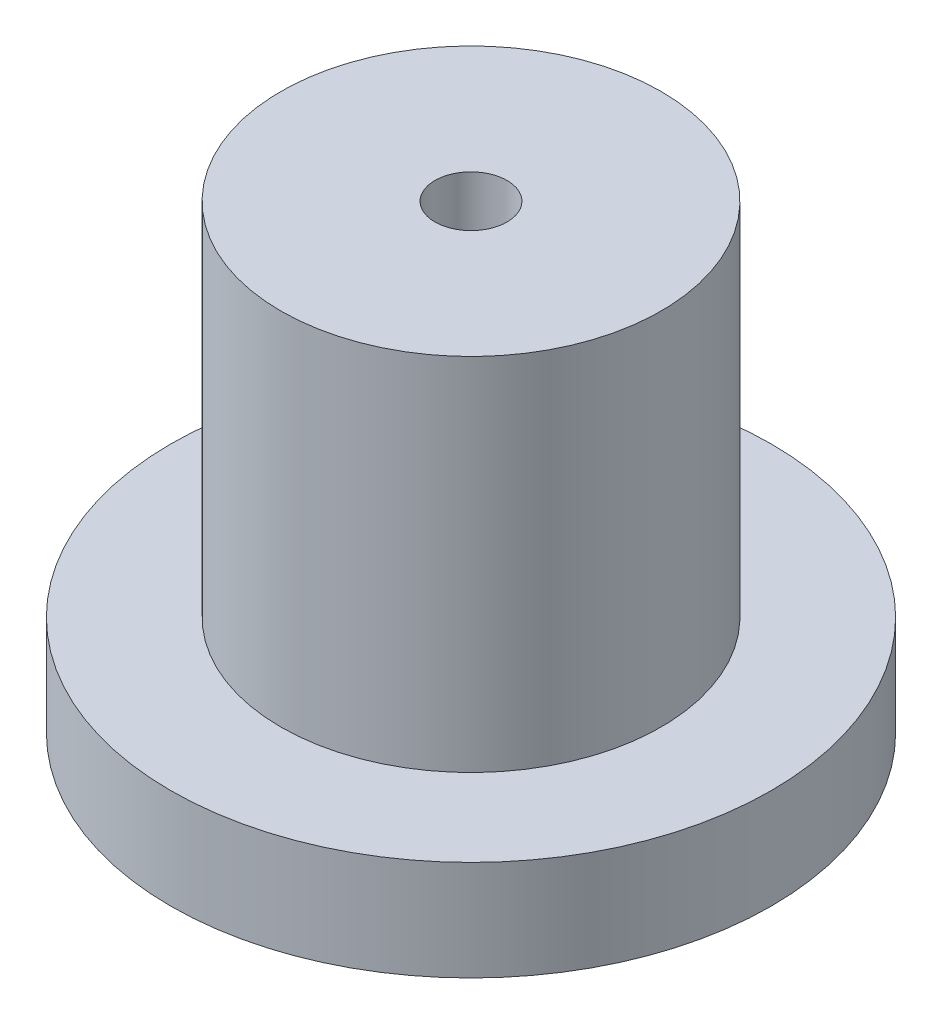
ISO-10303-21;
HEADER;
FILE_DESCRIPTION(('STEP AP214'),'2;1');
FILE_NAME('part.step','',(''),(''),'','','');
FILE_SCHEMA(('AUTOMOTIVE_DESIGN { 1 0 10303 214 1 1 1 1 }'));
ENDSEC;
DATA;
#1=APPLICATION_CONTEXT('core data for automotive mechanical design processes');
#2=APPLICATION_PROTOCOL_DEFINITION('international standard','automotive_design',2000,#1);
#3=PRODUCT_CONTEXT('',#1,'mechanical');
#4=PRODUCT('Part','Part','',(#3));
#5=PRODUCT_RELATED_PRODUCT_CATEGORY('part','',(#4));
#6=PRODUCT_DEFINITION_FORMATION('','',#4);
#7=PRODUCT_DEFINITION_CONTEXT('part definition',#1,'design');
#8=PRODUCT_DEFINITION('design','',#6,#7);
#9=PRODUCT_DEFINITION_SHAPE('','',#8);
#10=(LENGTH_UNIT() NAMED_UNIT(*) SI_UNIT(.MILLI.,.METRE.));
#11=(NAMED_UNIT(*) PLANE_ANGLE_UNIT() SI_UNIT($,.RADIAN.));
#12=(NAMED_UNIT(*) SI_UNIT($,.STERADIAN.) SOLID_ANGLE_UNIT());
#13=UNCERTAINTY_MEASURE_WITH_UNIT(LENGTH_MEASURE(1.E-05),#10,'distance_accuracy_value','');
#14=(GEOMETRIC_REPRESENTATION_CONTEXT(3) GLOBAL_UNCERTAINTY_ASSIGNED_CONTEXT((#13)) GLOBAL_UNIT_ASSIGNED_CONTEXT((#10,
#11,#12)) REPRESENTATION_CONTEXT('',''));
#15=CARTESIAN_POINT('',(0.,0.,0.));
#16=DIRECTION('',(0.,0.,1.));
#17=DIRECTION('',(1.,0.,0.));
#18=AXIS2_PLACEMENT_3D('',#15,#16,#17);
#19=CARTESIAN_POINT('',(0.,5.,0.));
#20=DIRECTION('',(0.,-1.,0.));
#21=DIRECTION('',(0.,0.,-1.));
#22=AXIS2_PLACEMENT_3D('',#19,#20,#21);
#23=CYLINDRICAL_SURFACE('',#22,15.);
#24=CARTESIAN_POINT('',(0.,5.,0.));
#25=DIRECTION('',(0.,1.,0.));
#26=DIRECTION('',(0.,0.,1.));
#27=AXIS2_PLACEMENT_3D('',#24,#25,#26);
#28=CIRCLE('',#27,15.);
#29=CARTESIAN_POINT('',(0.,5.,15.));
#30=VERTEX_POINT('',#29);
#31=EDGE_CURVE('E51',#30,#30,#28,.T.);
#32=ORIENTED_EDGE('',*,*,#31,.F.);
#33=EDGE_LOOP('',(#32));
#34=FACE_BOUND('',#33,.T.);
#35=CARTESIAN_POINT('',(0.,0.,0.));
#36=DIRECTION('',(0.,1.,0.));
#37=DIRECTION('',(0.,0.,1.));
#38=AXIS2_PLACEMENT_3D('',#35,#36,#37);
#39=CIRCLE('',#38,15.);
#40=CARTESIAN_POINT('',(0.,0.,15.));
#41=VERTEX_POINT('',#40);
#42=EDGE_CURVE('E57',#41,#41,#39,.T.);
#43=ORIENTED_EDGE('',*,*,#42,.T.);
#44=EDGE_LOOP('',(#43));
#45=FACE_BOUND('',#44,.T.);
#46=ADVANCED_FACE('F43',(#34,#45),#23,.T.);
#47=CARTESIAN_POINT('',(0.,5.,0.));
#48=DIRECTION('',(0.,1.,0.));
#49=DIRECTION('',(0.,0.,1.));
#50=AXIS2_PLACEMENT_3D('',#47,#48,#49);
#51=PLANE('',#50);
#52=CARTESIAN_POINT('',(0.,5.,0.));
#53=DIRECTION('',(0.,1.,0.));
#54=DIRECTION('',(0.,0.,1.));
#55=AXIS2_PLACEMENT_3D('',#52,#53,#54);
#56=CIRCLE('',#55,9.5);
#57=CARTESIAN_POINT('',(0.,5.,9.5));
#58=VERTEX_POINT('',#57);
#59=EDGE_CURVE('E10',#58,#58,#56,.T.);
#60=ORIENTED_EDGE('',*,*,#59,.F.);
#61=EDGE_LOOP('',(#60));
#62=FACE_BOUND('',#61,.T.);
#63=ORIENTED_EDGE('',*,*,#31,.T.);
#64=EDGE_LOOP('',(#63));
#65=FACE_BOUND('',#64,.T.);
#66=ADVANCED_FACE('F105',(#62,#65),#51,.T.);
#67=CARTESIAN_POINT('',(0.,0.,0.));
#68=DIRECTION('',(0.,1.,0.));
#69=DIRECTION('',(0.,0.,1.));
#70=AXIS2_PLACEMENT_3D('',#67,#68,#69);
#71=PLANE('',#70);
#72=CARTESIAN_POINT('',(0.,0.,0.));
#73=DIRECTION('',(0.,-1.,0.));
#74=DIRECTION('',(0.,0.,-1.));
#75=AXIS2_PLACEMENT_3D('',#72,#73,#74);
#76=CIRCLE('',#75,7.5);
#77=CARTESIAN_POINT('',(0.,0.,-7.5));
#78=VERTEX_POINT('',#77);
#79=EDGE_CURVE('E73',#78,#78,#76,.T.);
#80=ORIENTED_EDGE('',*,*,#79,.F.);
#81=EDGE_LOOP('',(#80));
#82=FACE_BOUND('',#81,.T.);
#83=ORIENTED_EDGE('',*,*,#42,.F.);
#84=EDGE_LOOP('',(#83));
#85=FACE_BOUND('',#84,.T.);
#86=ADVANCED_FACE('F110',(#82,#85),#71,.F.);
#87=CARTESIAN_POINT('',(0.,23.,0.));
#88=DIRECTION('',(0.,-1.,0.));
#89=DIRECTION('',(0.,0.,-1.));
#90=AXIS2_PLACEMENT_3D('',#87,#88,#89);
#91=CYLINDRICAL_SURFACE('',#90,9.5);
#92=CARTESIAN_POINT('',(0.,23.,0.));
#93=DIRECTION('',(0.,1.,0.));
#94=DIRECTION('',(0.,0.,1.));
#95=AXIS2_PLACEMENT_3D('',#92,#93,#94);
#96=CIRCLE('',#95,9.5);
#97=CARTESIAN_POINT('',(0.,23.,9.5));
#98=VERTEX_POINT('',#97);
#99=EDGE_CURVE('E60',#98,#98,#96,.T.);
#100=ORIENTED_EDGE('',*,*,#99,.F.);
#101=EDGE_LOOP('',(#100));
#102=FACE_BOUND('',#101,.T.);
#103=ORIENTED_EDGE('',*,*,#59,.T.);
#104=EDGE_LOOP('',(#103));
#105=FACE_BOUND('',#104,.T.);
#106=ADVANCED_FACE('F119',(#102,#105),#91,.T.);
#107=CARTESIAN_POINT('',(0.,23.,0.));
#108=DIRECTION('',(0.,1.,0.));
#109=DIRECTION('',(0.,0.,1.));
#110=AXIS2_PLACEMENT_3D('',#107,#108,#109);
#111=PLANE('',#110);
#112=CARTESIAN_POINT('',(0.,23.,0.));
#113=DIRECTION('',(0.,1.,0.));
#114=DIRECTION('',(0.,0.,1.));
#115=AXIS2_PLACEMENT_3D('',#112,#113,#114);
#116=CIRCLE('',#115,1.8);
#117=CARTESIAN_POINT('',(0.,23.,1.8));
#118=VERTEX_POINT('',#117);
#119=EDGE_CURVE('E80',#118,#118,#116,.T.);
#120=ORIENTED_EDGE('',*,*,#119,.F.);
#121=EDGE_LOOP('',(#120));
#122=FACE_BOUND('',#121,.T.);
#123=ORIENTED_EDGE('',*,*,#99,.T.);
#124=EDGE_LOOP('',(#123));
#125=FACE_BOUND('',#124,.T.);
#126=ADVANCED_FACE('F101',(#122,#125),#111,.T.);
#127=CARTESIAN_POINT('',(0.,18.,0.));
#128=DIRECTION('',(0.,-1.,0.));
#129=DIRECTION('',(0.,0.,-1.));
#130=AXIS2_PLACEMENT_3D('',#127,#128,#129);
#131=CYLINDRICAL_SURFACE('',#130,7.5);
#132=CARTESIAN_POINT('',(0.,18.,0.));
#133=DIRECTION('',(0.,-1.,0.));
#134=DIRECTION('',(0.,0.,-1.));
#135=AXIS2_PLACEMENT_3D('',#132,#133,#134);
#136=CIRCLE('',#135,7.5);
#137=CARTESIAN_POINT('',(0.,18.,-7.5));
#138=VERTEX_POINT('',#137);
#139=EDGE_CURVE('E68',#138,#138,#136,.T.);
#140=ORIENTED_EDGE('',*,*,#139,.F.);
#141=EDGE_LOOP('',(#140));
#142=FACE_BOUND('',#141,.T.);
#143=ORIENTED_EDGE('',*,*,#79,.T.);
#144=EDGE_LOOP('',(#143));
#145=FACE_BOUND('',#144,.T.);
#146=ADVANCED_FACE('F93',(#142,#145),#131,.F.);
#147=CARTESIAN_POINT('',(0.,18.,0.));
#148=DIRECTION('',(0.,-1.,0.));
#149=DIRECTION('',(0.,0.,-1.));
#150=AXIS2_PLACEMENT_3D('',#147,#148,#149);
#151=PLANE('',#150);
#152=CARTESIAN_POINT('',(0.,18.,0.));
#153=DIRECTION('',(0.,-1.,0.));
#154=DIRECTION('',(0.,0.,-1.));
#155=AXIS2_PLACEMENT_3D('',#152,#153,#154);
#156=CIRCLE('',#155,1.8);
#157=CARTESIAN_POINT('',(0.,18.,-1.8));
#158=VERTEX_POINT('',#157);
#159=EDGE_CURVE('E46',#158,#158,#156,.T.);
#160=ORIENTED_EDGE('',*,*,#159,.F.);
#161=EDGE_LOOP('',(#160));
#162=FACE_BOUND('',#161,.T.);
#163=ORIENTED_EDGE('',*,*,#139,.T.);
#164=EDGE_LOOP('',(#163));
#165=FACE_BOUND('',#164,.T.);
#166=ADVANCED_FACE('F91',(#162,#165),#151,.T.);
#167=CARTESIAN_POINT('',(0.,23.,0.));
#168=DIRECTION('',(0.,1.,0.));
#169=DIRECTION('',(0.,0.,1.));
#170=AXIS2_PLACEMENT_3D('',#167,#168,#169);
#171=CYLINDRICAL_SURFACE('',#170,1.8);
#172=ORIENTED_EDGE('',*,*,#159,.T.);
#173=EDGE_LOOP('',(#172));
#174=FACE_BOUND('',#173,.T.);
#175=ORIENTED_EDGE('',*,*,#119,.T.);
#176=EDGE_LOOP('',(#175));
#177=FACE_BOUND('',#176,.T.);
#178=ADVANCED_FACE('F89',(#174,#177),#171,.F.);
#179=CLOSED_SHELL('',(#46,#66,#86,#106,#126,#146,#166,#178));
#180=MANIFOLD_SOLID_BREP('B2',#179);
#181=ADVANCED_BREP_SHAPE_REPRESENTATION('',(#18,#180),#14);
#182=SHAPE_DEFINITION_REPRESENTATION(#9,#181);
ENDSEC;
END-ISO-10303-21;
